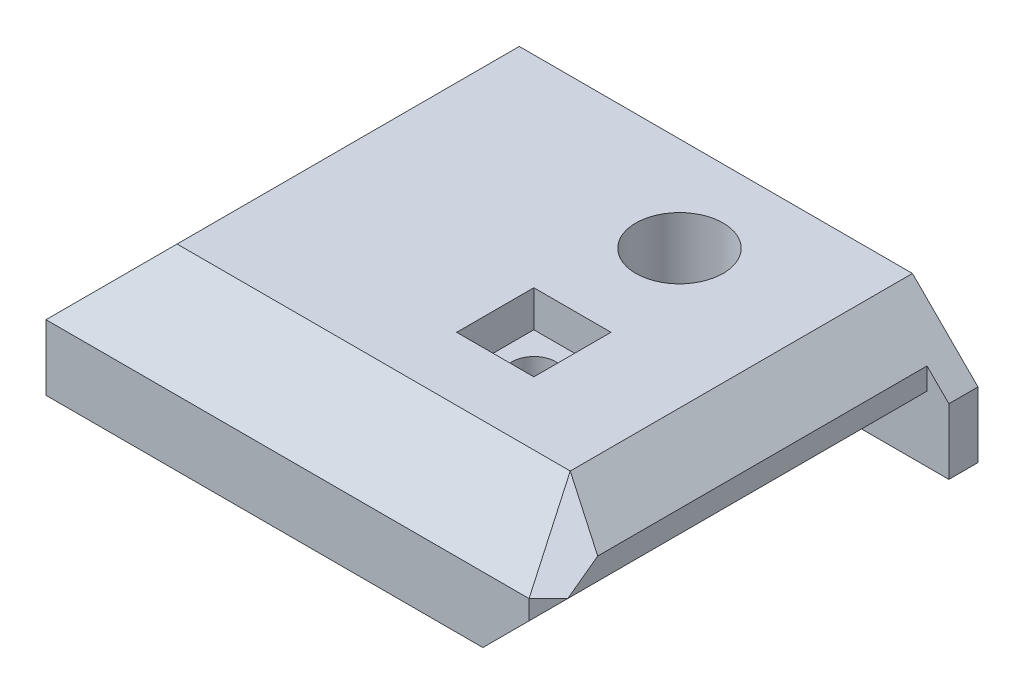
ISO-10303-21;
HEADER;
FILE_DESCRIPTION(('STEP AP214'),'2;1');
FILE_NAME('part.step','',(''),(''),'','','');
FILE_SCHEMA(('AUTOMOTIVE_DESIGN { 1 0 10303 214 1 1 1 1 }'));
ENDSEC;
DATA;
#1=APPLICATION_CONTEXT('core data for automotive mechanical design processes');
#2=APPLICATION_PROTOCOL_DEFINITION('international standard','automotive_design',2000,#1);
#3=PRODUCT_CONTEXT('',#1,'mechanical');
#4=PRODUCT('Part','Part','',(#3));
#5=PRODUCT_RELATED_PRODUCT_CATEGORY('part','',(#4));
#6=PRODUCT_DEFINITION_FORMATION('','',#4);
#7=PRODUCT_DEFINITION_CONTEXT('part definition',#1,'design');
#8=PRODUCT_DEFINITION('design','',#6,#7);
#9=PRODUCT_DEFINITION_SHAPE('','',#8);
#10=(LENGTH_UNIT() NAMED_UNIT(*) SI_UNIT(.MILLI.,.METRE.));
#11=(NAMED_UNIT(*) PLANE_ANGLE_UNIT() SI_UNIT($,.RADIAN.));
#12=(NAMED_UNIT(*) SI_UNIT($,.STERADIAN.) SOLID_ANGLE_UNIT());
#13=UNCERTAINTY_MEASURE_WITH_UNIT(LENGTH_MEASURE(1.E-05),#10,'distance_accuracy_value','');
#14=(GEOMETRIC_REPRESENTATION_CONTEXT(3) GLOBAL_UNCERTAINTY_ASSIGNED_CONTEXT((#13)) GLOBAL_UNIT_ASSIGNED_CONTEXT((#10,
#11,#12)) REPRESENTATION_CONTEXT('',''));
#15=CARTESIAN_POINT('',(0.,0.,0.));
#16=DIRECTION('',(0.,0.,1.));
#17=DIRECTION('',(1.,0.,0.));
#18=AXIS2_PLACEMENT_3D('',#15,#16,#17);
#19=CARTESIAN_POINT('',(36.,0.,28.));
#20=DIRECTION('',(0.,1.,0.));
#21=DIRECTION('',(0.,0.,1.));
#22=AXIS2_PLACEMENT_3D('',#19,#20,#21);
#23=PLANE('',#22);
#24=CARTESIAN_POINT('',(22.,0.,16.5));
#25=DIRECTION('',(0.,1.,0.));
#26=DIRECTION('',(0.,0.,1.));
#27=AXIS2_PLACEMENT_3D('',#24,#25,#26);
#28=CIRCLE('',#27,1.5);
#29=CARTESIAN_POINT('',(22.,0.,18.));
#30=VERTEX_POINT('',#29);
#31=EDGE_CURVE('E217',#30,#30,#28,.T.);
#32=ORIENTED_EDGE('',*,*,#31,.T.);
#33=EDGE_LOOP('',(#32));
#34=FACE_BOUND('',#33,.T.);
#35=CARTESIAN_POINT('',(22.,0.,6.5));
#36=DIRECTION('',(0.,1.,0.));
#37=DIRECTION('',(0.,0.,1.));
#38=AXIS2_PLACEMENT_3D('',#35,#36,#37);
#39=CIRCLE('',#38,1.5);
#40=CARTESIAN_POINT('',(22.,0.,8.));
#41=VERTEX_POINT('',#40);
#42=EDGE_CURVE('E223',#41,#41,#39,.F.);
#43=ORIENTED_EDGE('',*,*,#42,.F.);
#44=EDGE_LOOP('',(#43));
#45=FACE_BOUND('',#44,.T.);
#46=DIRECTION('',(1.,0.,0.));
#47=VECTOR('',#46,1.);
#48=CARTESIAN_POINT('',(36.,0.,2.));
#49=LINE('',#48,#47);
#50=CARTESIAN_POINT('',(30.,0.,2.));
#51=VERTEX_POINT('',#50);
#52=CARTESIAN_POINT('',(36.,0.,2.));
#53=VERTEX_POINT('',#52);
#54=EDGE_CURVE('E240',#51,#53,#49,.T.);
#55=ORIENTED_EDGE('',*,*,#54,.F.);
#56=DIRECTION('',(0.,0.,1.));
#57=VECTOR('',#56,1.);
#58=CARTESIAN_POINT('',(30.,0.,2.));
#59=LINE('',#58,#57);
#60=CARTESIAN_POINT('',(30.,0.,28.));
#61=VERTEX_POINT('',#60);
#62=EDGE_CURVE('E242',#51,#61,#59,.T.);
#63=ORIENTED_EDGE('',*,*,#62,.T.);
#64=DIRECTION('',(1.,0.,0.));
#65=VECTOR('',#64,1.);
#66=CARTESIAN_POINT('',(36.,0.,28.));
#67=LINE('',#66,#65);
#68=CARTESIAN_POINT('',(0.,0.,28.));
#69=VERTEX_POINT('',#68);
#70=EDGE_CURVE('E326',#69,#61,#67,.T.);
#71=ORIENTED_EDGE('',*,*,#70,.F.);
#72=DIRECTION('',(0.,0.,-1.));
#73=VECTOR('',#72,1.);
#74=CARTESIAN_POINT('',(0.,0.,28.));
#75=LINE('',#74,#73);
#76=CARTESIAN_POINT('',(0.,0.,0.));
#77=VERTEX_POINT('',#76);
#78=EDGE_CURVE('E332',#69,#77,#75,.T.);
#79=ORIENTED_EDGE('',*,*,#78,.T.);
#80=DIRECTION('',(1.,0.,0.));
#81=VECTOR('',#80,1.);
#82=CARTESIAN_POINT('',(36.,0.,0.));
#83=LINE('',#82,#81);
#84=CARTESIAN_POINT('',(5.,0.,0.));
#85=VERTEX_POINT('',#84);
#86=EDGE_CURVE('E333',#77,#85,#83,.T.);
#87=ORIENTED_EDGE('',*,*,#86,.T.);
#88=DIRECTION('',(0.,0.,-1.));
#89=VECTOR('',#88,1.);
#90=CARTESIAN_POINT('',(5.,0.,26.));
#91=LINE('',#90,#89);
#92=CARTESIAN_POINT('',(5.,0.,26.));
#93=VERTEX_POINT('',#92);
#94=EDGE_CURVE('E268',#93,#85,#91,.T.);
#95=ORIENTED_EDGE('',*,*,#94,.F.);
#96=DIRECTION('',(1.,0.,0.));
#97=VECTOR('',#96,1.);
#98=CARTESIAN_POINT('',(5.,0.,26.));
#99=LINE('',#98,#97);
#100=CARTESIAN_POINT('',(13.8116308862596,0.,26.));
#101=VERTEX_POINT('',#100);
#102=EDGE_CURVE('E254',#93,#101,#99,.T.);
#103=ORIENTED_EDGE('',*,*,#102,.T.);
#104=DIRECTION('',(0.,0.,-1.));
#105=VECTOR('',#104,1.);
#106=CARTESIAN_POINT('',(13.8116308862596,0.,26.));
#107=LINE('',#106,#105);
#108=CARTESIAN_POINT('',(13.8116308862596,0.,0.));
#109=VERTEX_POINT('',#108);
#110=EDGE_CURVE('E291',#101,#109,#107,.T.);
#111=ORIENTED_EDGE('',*,*,#110,.T.);
#112=CARTESIAN_POINT('',(36.,0.,0.));
#113=VERTEX_POINT('',#112);
#114=EDGE_CURVE('E320',#109,#113,#83,.T.);
#115=ORIENTED_EDGE('',*,*,#114,.T.);
#116=DIRECTION('',(0.,0.,-1.));
#117=VECTOR('',#116,1.);
#118=CARTESIAN_POINT('',(36.,0.,28.));
#119=LINE('',#118,#117);
#120=EDGE_CURVE('E345',#53,#113,#119,.T.);
#121=ORIENTED_EDGE('',*,*,#120,.F.);
#122=EDGE_LOOP('',(#55,#63,#71,#79,#87,#95,#103,#111,#115,#121));
#123=FACE_BOUND('',#122,.T.);
#124=ADVANCED_FACE('F41',(#34,#45,#123),#23,.F.);
#125=CARTESIAN_POINT('',(0.,0.,0.));
#126=DIRECTION('',(0.,0.,-1.));
#127=DIRECTION('',(-1.,0.,0.));
#128=AXIS2_PLACEMENT_3D('',#125,#126,#127);
#129=PLANE('',#128);
#130=ORIENTED_EDGE('',*,*,#114,.F.);
#131=DIRECTION('',(0.,1.,0.));
#132=VECTOR('',#131,1.);
#133=CARTESIAN_POINT('',(13.8116308862596,0.,0.));
#134=LINE('',#133,#132);
#135=CARTESIAN_POINT('',(13.8116308862596,3.,0.));
#136=VERTEX_POINT('',#135);
#137=EDGE_CURVE('E253',#109,#136,#134,.T.);
#138=ORIENTED_EDGE('',*,*,#137,.T.);
#139=DIRECTION('',(-0.707106781186551,0.707106781186544,0.));
#140=VECTOR('',#139,1.);
#141=CARTESIAN_POINT('',(13.8116308862596,3.,0.));
#142=LINE('',#141,#140);
#143=CARTESIAN_POINT('',(13.104524105073,3.70710678118655,0.));
#144=VERTEX_POINT('',#143);
#145=EDGE_CURVE('E271',#136,#144,#142,.T.);
#146=ORIENTED_EDGE('',*,*,#145,.T.);
#147=DIRECTION('',(-1.,0.,0.));
#148=VECTOR('',#147,1.);
#149=CARTESIAN_POINT('',(5.70710678118655,3.70710678118655,0.));
#150=LINE('',#149,#148);
#151=CARTESIAN_POINT('',(5.70710678118655,3.70710678118655,0.));
#152=VERTEX_POINT('',#151);
#153=EDGE_CURVE('E274',#144,#152,#150,.T.);
#154=ORIENTED_EDGE('',*,*,#153,.T.);
#155=DIRECTION('',(-0.707106781186547,-0.707106781186547,0.));
#156=VECTOR('',#155,1.);
#157=CARTESIAN_POINT('',(5.,3.,0.));
#158=LINE('',#157,#156);
#159=CARTESIAN_POINT('',(5.,3.,0.));
#160=VERTEX_POINT('',#159);
#161=EDGE_CURVE('E277',#152,#160,#158,.T.);
#162=ORIENTED_EDGE('',*,*,#161,.T.);
#163=DIRECTION('',(0.,-1.,0.));
#164=VECTOR('',#163,1.);
#165=CARTESIAN_POINT('',(5.,0.,0.));
#166=LINE('',#165,#164);
#167=EDGE_CURVE('E258',#160,#85,#166,.T.);
#168=ORIENTED_EDGE('',*,*,#167,.T.);
#169=ORIENTED_EDGE('',*,*,#86,.F.);
#170=DIRECTION('',(0.,-1.,0.));
#171=VECTOR('',#170,1.);
#172=CARTESIAN_POINT('',(0.,0.,0.));
#173=LINE('',#172,#171);
#174=CARTESIAN_POINT('',(0.,4.5,0.));
#175=VERTEX_POINT('',#174);
#176=EDGE_CURVE('E330',#175,#77,#173,.T.);
#177=ORIENTED_EDGE('',*,*,#176,.F.);
#178=DIRECTION('',(0.707106781186546,0.707106781186549,0.));
#179=VECTOR('',#178,1.);
#180=CARTESIAN_POINT('',(0.,4.5,0.));
#181=LINE('',#180,#179);
#182=CARTESIAN_POINT('',(4.49999999999998,9.,0.));
#183=VERTEX_POINT('',#182);
#184=EDGE_CURVE('E311',#175,#183,#181,.T.);
#185=ORIENTED_EDGE('',*,*,#184,.T.);
#186=DIRECTION('',(-1.,0.,0.));
#187=VECTOR('',#186,1.);
#188=CARTESIAN_POINT('',(0.,9.,0.));
#189=LINE('',#188,#187);
#190=CARTESIAN_POINT('',(31.5,9.,0.));
#191=VERTEX_POINT('',#190);
#192=EDGE_CURVE('E339',#191,#183,#189,.T.);
#193=ORIENTED_EDGE('',*,*,#192,.F.);
#194=DIRECTION('',(0.707106781186546,-0.707106781186549,0.));
#195=VECTOR('',#194,1.);
#196=CARTESIAN_POINT('',(36.,4.5,0.));
#197=LINE('',#196,#195);
#198=CARTESIAN_POINT('',(36.,4.50000000000001,0.));
#199=VERTEX_POINT('',#198);
#200=EDGE_CURVE('E315',#191,#199,#197,.T.);
#201=ORIENTED_EDGE('',*,*,#200,.T.);
#202=DIRECTION('',(0.,1.,0.));
#203=VECTOR('',#202,1.);
#204=CARTESIAN_POINT('',(36.,9.,0.));
#205=LINE('',#204,#203);
#206=EDGE_CURVE('E336',#113,#199,#205,.T.);
#207=ORIENTED_EDGE('',*,*,#206,.F.);
#208=EDGE_LOOP('',(#130,#138,#146,#154,#162,#168,#169,#177,#185,#193,#201,#207));
#209=FACE_BOUND('',#208,.T.);
#210=ADVANCED_FACE('F379',(#209),#129,.T.);
#211=CARTESIAN_POINT('',(36.,4.5,28.));
#212=DIRECTION('',(0.707106781186549,0.707106781186547,0.));
#213=DIRECTION('',(-0.707106781186546,0.707106781186549,0.));
#214=AXIS2_PLACEMENT_3D('',#211,#212,#213);
#215=PLANE('',#214);
#216=DIRECTION('',(0.,0.,1.));
#217=VECTOR('',#216,1.);
#218=CARTESIAN_POINT('',(34.5,5.99999999999998,2.));
#219=LINE('',#218,#217);
#220=CARTESIAN_POINT('',(34.5,5.99999999999998,2.));
#221=VERTEX_POINT('',#220);
#222=CARTESIAN_POINT('',(34.5,5.99999999999998,24.6143819168359));
#223=VERTEX_POINT('',#222);
#224=EDGE_CURVE('E64',#221,#223,#219,.T.);
#225=ORIENTED_EDGE('',*,*,#224,.F.);
#226=DIRECTION('',(-0.707106781186546,0.707106781186549,0.));
#227=VECTOR('',#226,1.);
#228=CARTESIAN_POINT('',(36.,4.5,2.));
#229=LINE('',#228,#227);
#230=CARTESIAN_POINT('',(36.,4.50000000000001,2.));
#231=VERTEX_POINT('',#230);
#232=EDGE_CURVE('E245',#231,#221,#229,.T.);
#233=ORIENTED_EDGE('',*,*,#232,.F.);
#234=DIRECTION('',(0.,0.,-1.));
#235=VECTOR('',#234,1.);
#236=CARTESIAN_POINT('',(36.,4.5,28.));
#237=LINE('',#236,#235);
#238=EDGE_CURVE('E322',#231,#199,#237,.T.);
#239=ORIENTED_EDGE('',*,*,#238,.T.);
#240=ORIENTED_EDGE('',*,*,#200,.F.);
#241=DIRECTION('',(0.,0.,-1.));
#242=VECTOR('',#241,1.);
#243=CARTESIAN_POINT('',(31.5,9.,28.));
#244=LINE('',#243,#242);
#245=CARTESIAN_POINT('',(31.5,9.,23.5));
#246=VERTEX_POINT('',#245);
#247=EDGE_CURVE('E310',#246,#191,#244,.T.);
#248=ORIENTED_EDGE('',*,*,#247,.F.);
#249=DIRECTION('',(0.683908301776168,-0.68390830177617,0.254045014757763));
#250=VECTOR('',#249,1.);
#251=CARTESIAN_POINT('',(36.4914208129248,4.00857918707516,25.3541163644139));
#252=LINE('',#251,#250);
#253=EDGE_CURVE('E300',#246,#223,#252,.T.);
#254=ORIENTED_EDGE('',*,*,#253,.T.);
#255=EDGE_LOOP('',(#225,#233,#239,#240,#248,#254));
#256=FACE_BOUND('',#255,.T.);
#257=ADVANCED_FACE('F372',(#256),#215,.T.);
#258=CARTESIAN_POINT('',(36.,4.5,28.));
#259=DIRECTION('',(0.,0.707106781186546,0.707106781186549));
#260=DIRECTION('',(0.,-0.707106781186549,0.707106781186546));
#261=AXIS2_PLACEMENT_3D('',#258,#259,#260);
#262=PLANE('',#261);
#263=DIRECTION('',(-1.,0.,0.));
#264=VECTOR('',#263,1.);
#265=CARTESIAN_POINT('',(36.,4.5,28.));
#266=LINE('',#265,#264);
#267=CARTESIAN_POINT('',(33.1715728752538,4.5,28.));
#268=VERTEX_POINT('',#267);
#269=CARTESIAN_POINT('',(0.,4.5,28.));
#270=VERTEX_POINT('',#269);
#271=EDGE_CURVE('E308',#268,#270,#266,.T.);
#272=ORIENTED_EDGE('',*,*,#271,.F.);
#273=DIRECTION('',(-0.254045014757767,0.68390830177617,-0.683908301776167));
#274=VECTOR('',#273,1.);
#275=CARTESIAN_POINT('',(33.3541163644139,4.00857918707515,28.4914208129248));
#276=LINE('',#275,#274);
#277=EDGE_CURVE('E297',#268,#246,#276,.T.);
#278=ORIENTED_EDGE('',*,*,#277,.T.);
#279=DIRECTION('',(-1.,0.,0.));
#280=VECTOR('',#279,1.);
#281=CARTESIAN_POINT('',(36.,9.,23.5));
#282=LINE('',#281,#280);
#283=CARTESIAN_POINT('',(4.49999999999998,9.,23.5));
#284=VERTEX_POINT('',#283);
#285=EDGE_CURVE('E306',#246,#284,#282,.T.);
#286=ORIENTED_EDGE('',*,*,#285,.T.);
#287=DIRECTION('',(0.577350269189625,0.577350269189627,-0.577350269189625));
#288=VECTOR('',#287,1.);
#289=CARTESIAN_POINT('',(0.,4.5,28.));
#290=LINE('',#289,#288);
#291=EDGE_CURVE('E347',#270,#284,#290,.T.);
#292=ORIENTED_EDGE('',*,*,#291,.F.);
#293=EDGE_LOOP('',(#272,#278,#286,#292));
#294=FACE_BOUND('',#293,.T.);
#295=ADVANCED_FACE('F364',(#294),#262,.T.);
#296=CARTESIAN_POINT('',(30.585786437627,0.,30.5857864376269));
#297=DIRECTION('',(0.707106781186549,0.,0.707106781186546));
#298=DIRECTION('',(0.707106781186546,0.,-0.707106781186549));
#299=AXIS2_PLACEMENT_3D('',#296,#297,#298);
#300=PLANE('',#299);
#301=DIRECTION('',(-0.577350269189626,-0.577350269189623,0.577350269189628));
#302=VECTOR('',#301,1.);
#303=CARTESIAN_POINT('',(30.3905242917513,0.390524291751312,30.7810485835025));
#304=LINE('',#303,#302);
#305=CARTESIAN_POINT('',(34.5,4.5,26.6715728752538));
#306=VERTEX_POINT('',#305);
#307=CARTESIAN_POINT('',(33.1715728752538,3.17157287525381,28.));
#308=VERTEX_POINT('',#307);
#309=EDGE_CURVE('E251',#306,#308,#304,.T.);
#310=ORIENTED_EDGE('',*,*,#309,.F.);
#311=DIRECTION('',(0.707106781186546,0.,-0.707106781186549));
#312=VECTOR('',#311,1.);
#313=CARTESIAN_POINT('',(33.1715728752538,4.5,28.));
#314=LINE('',#313,#312);
#315=EDGE_CURVE('E294',#268,#306,#314,.T.);
#316=ORIENTED_EDGE('',*,*,#315,.F.);
#317=DIRECTION('',(0.,-1.,0.));
#318=VECTOR('',#317,1.);
#319=CARTESIAN_POINT('',(33.1715728752538,0.,28.));
#320=LINE('',#319,#318);
#321=EDGE_CURVE('E303',#268,#308,#320,.T.);
#322=ORIENTED_EDGE('',*,*,#321,.T.);
#323=EDGE_LOOP('',(#310,#316,#322));
#324=FACE_BOUND('',#323,.T.);
#325=ADVANCED_FACE('F358',(#324),#300,.T.);
#326=CARTESIAN_POINT('',(0.,0.,28.));
#327=DIRECTION('',(0.,0.,-1.));
#328=DIRECTION('',(-1.,0.,0.));
#329=AXIS2_PLACEMENT_3D('',#326,#327,#328);
#330=PLANE('',#329);
#331=ORIENTED_EDGE('',*,*,#70,.T.);
#332=DIRECTION('',(0.70710678118655,0.707106781186545,0.));
#333=VECTOR('',#332,1.);
#334=CARTESIAN_POINT('',(14.9999999999999,-15.,28.));
#335=LINE('',#334,#333);
#336=EDGE_CURVE('E11',#61,#308,#335,.T.);
#337=ORIENTED_EDGE('',*,*,#336,.T.);
#338=ORIENTED_EDGE('',*,*,#321,.F.);
#339=ORIENTED_EDGE('',*,*,#271,.T.);
#340=DIRECTION('',(0.,-1.,0.));
#341=VECTOR('',#340,1.);
#342=CARTESIAN_POINT('',(0.,0.,28.));
#343=LINE('',#342,#341);
#344=EDGE_CURVE('E329',#270,#69,#343,.T.);
#345=ORIENTED_EDGE('',*,*,#344,.T.);
#346=EDGE_LOOP('',(#331,#337,#338,#339,#345));
#347=FACE_BOUND('',#346,.T.);
#348=ADVANCED_FACE('F391',(#347),#330,.F.);
#349=CARTESIAN_POINT('',(36.,9.,28.));
#350=DIRECTION('',(-1.,0.,0.));
#351=DIRECTION('',(0.,0.,1.));
#352=AXIS2_PLACEMENT_3D('',#349,#350,#351);
#353=PLANE('',#352);
#354=ORIENTED_EDGE('',*,*,#238,.F.);
#355=DIRECTION('',(0.,1.,0.));
#356=VECTOR('',#355,1.);
#357=CARTESIAN_POINT('',(36.,5.99999999999998,2.));
#358=LINE('',#357,#356);
#359=EDGE_CURVE('E230',#53,#231,#358,.T.);
#360=ORIENTED_EDGE('',*,*,#359,.F.);
#361=ORIENTED_EDGE('',*,*,#120,.T.);
#362=ORIENTED_EDGE('',*,*,#206,.T.);
#363=EDGE_LOOP('',(#354,#360,#361,#362));
#364=FACE_BOUND('',#363,.T.);
#365=ADVANCED_FACE('F400',(#364),#353,.F.);
#366=CARTESIAN_POINT('',(0.,9.,28.));
#367=DIRECTION('',(0.,-1.,0.));
#368=DIRECTION('',(0.,0.,-1.));
#369=AXIS2_PLACEMENT_3D('',#366,#367,#368);
#370=PLANE('',#369);
#371=DIRECTION('',(1.,0.,0.));
#372=VECTOR('',#371,1.);
#373=CARTESIAN_POINT('',(19.35,9.,19.15));
#374=LINE('',#373,#372);
#375=CARTESIAN_POINT('',(19.35,9.,19.15));
#376=VERTEX_POINT('',#375);
#377=CARTESIAN_POINT('',(24.65,9.,19.15));
#378=VERTEX_POINT('',#377);
#379=EDGE_CURVE('E208',#376,#378,#374,.T.);
#380=ORIENTED_EDGE('',*,*,#379,.F.);
#381=DIRECTION('',(0.,0.,1.));
#382=VECTOR('',#381,1.);
#383=CARTESIAN_POINT('',(19.35,9.,19.15));
#384=LINE('',#383,#382);
#385=CARTESIAN_POINT('',(19.35,9.,13.85));
#386=VERTEX_POINT('',#385);
#387=EDGE_CURVE('E56',#386,#376,#384,.T.);
#388=ORIENTED_EDGE('',*,*,#387,.F.);
#389=DIRECTION('',(-1.,0.,0.));
#390=VECTOR('',#389,1.);
#391=CARTESIAN_POINT('',(19.35,9.,13.85));
#392=LINE('',#391,#390);
#393=CARTESIAN_POINT('',(24.65,9.,13.85));
#394=VERTEX_POINT('',#393);
#395=EDGE_CURVE('E199',#394,#386,#392,.T.);
#396=ORIENTED_EDGE('',*,*,#395,.F.);
#397=DIRECTION('',(0.,0.,-1.));
#398=VECTOR('',#397,1.);
#399=CARTESIAN_POINT('',(24.65,9.,19.15));
#400=LINE('',#399,#398);
#401=EDGE_CURVE('E202',#378,#394,#400,.T.);
#402=ORIENTED_EDGE('',*,*,#401,.F.);
#403=EDGE_LOOP('',(#380,#388,#396,#402));
#404=FACE_BOUND('',#403,.T.);
#405=CARTESIAN_POINT('',(22.,9.,6.5));
#406=DIRECTION('',(0.,1.,0.));
#407=DIRECTION('',(0.,0.,1.));
#408=AXIS2_PLACEMENT_3D('',#405,#406,#407);
#409=CIRCLE('',#408,3.);
#410=CARTESIAN_POINT('',(22.,9.,9.5));
#411=VERTEX_POINT('',#410);
#412=EDGE_CURVE('E226',#411,#411,#409,.T.);
#413=ORIENTED_EDGE('',*,*,#412,.F.);
#414=EDGE_LOOP('',(#413));
#415=FACE_BOUND('',#414,.T.);
#416=ORIENTED_EDGE('',*,*,#285,.F.);
#417=ORIENTED_EDGE('',*,*,#247,.T.);
#418=ORIENTED_EDGE('',*,*,#192,.T.);
#419=DIRECTION('',(0.,0.,-1.));
#420=VECTOR('',#419,1.);
#421=CARTESIAN_POINT('',(4.49999999999998,9.,28.));
#422=LINE('',#421,#420);
#423=EDGE_CURVE('E314',#284,#183,#422,.T.);
#424=ORIENTED_EDGE('',*,*,#423,.F.);
#425=EDGE_LOOP('',(#416,#417,#418,#424));
#426=FACE_BOUND('',#425,.T.);
#427=ADVANCED_FACE('F369',(#404,#415,#426),#370,.F.);
#428=CARTESIAN_POINT('',(0.,4.5,28.));
#429=DIRECTION('',(-0.707106781186549,0.707106781186546,0.));
#430=DIRECTION('',(-0.707106781186546,-0.707106781186549,0.));
#431=AXIS2_PLACEMENT_3D('',#428,#429,#430);
#432=PLANE('',#431);
#433=DIRECTION('',(0.,0.,-1.));
#434=VECTOR('',#433,1.);
#435=CARTESIAN_POINT('',(0.,4.5,28.));
#436=LINE('',#435,#434);
#437=EDGE_CURVE('E317',#270,#175,#436,.T.);
#438=ORIENTED_EDGE('',*,*,#437,.F.);
#439=ORIENTED_EDGE('',*,*,#291,.T.);
#440=ORIENTED_EDGE('',*,*,#423,.T.);
#441=ORIENTED_EDGE('',*,*,#184,.F.);
#442=EDGE_LOOP('',(#438,#439,#440,#441));
#443=FACE_BOUND('',#442,.T.);
#444=ADVANCED_FACE('F384',(#443),#432,.T.);
#445=CARTESIAN_POINT('',(0.,0.,28.));
#446=DIRECTION('',(1.,0.,0.));
#447=DIRECTION('',(0.,0.,-1.));
#448=AXIS2_PLACEMENT_3D('',#445,#446,#447);
#449=PLANE('',#448);
#450=ORIENTED_EDGE('',*,*,#437,.T.);
#451=ORIENTED_EDGE('',*,*,#176,.T.);
#452=ORIENTED_EDGE('',*,*,#78,.F.);
#453=ORIENTED_EDGE('',*,*,#344,.F.);
#454=EDGE_LOOP('',(#450,#451,#452,#453));
#455=FACE_BOUND('',#454,.T.);
#456=ADVANCED_FACE('F387',(#455),#449,.F.);
#457=CARTESIAN_POINT('',(30.0857864376269,9.00000000000001,24.9142135623731));
#458=DIRECTION('',(0.507613933017222,0.696172528913327,0.507613933017219));
#459=DIRECTION('',(-0.808014088376717,0.589163163295826,0.));
#460=AXIS2_PLACEMENT_3D('',#457,#458,#459);
#461=PLANE('',#460);
#462=DIRECTION('',(0.,-0.589163163295823,0.808014088376719));
#463=VECTOR('',#462,1.);
#464=CARTESIAN_POINT('',(34.5,6.89860420356718,23.3819816216527));
#465=LINE('',#464,#463);
#466=EDGE_CURVE('E49',#223,#306,#465,.T.);
#467=ORIENTED_EDGE('',*,*,#466,.F.);
#468=ORIENTED_EDGE('',*,*,#253,.F.);
#469=ORIENTED_EDGE('',*,*,#277,.F.);
#470=ORIENTED_EDGE('',*,*,#315,.T.);
#471=EDGE_LOOP('',(#467,#468,#469,#470));
#472=FACE_BOUND('',#471,.T.);
#473=ADVANCED_FACE('F360',(#472),#461,.T.);
#474=CARTESIAN_POINT('',(13.8116308862596,0.,26.));
#475=DIRECTION('',(-1.,0.,0.));
#476=DIRECTION('',(0.,0.,1.));
#477=AXIS2_PLACEMENT_3D('',#474,#475,#476);
#478=PLANE('',#477);
#479=ORIENTED_EDGE('',*,*,#137,.F.);
#480=ORIENTED_EDGE('',*,*,#110,.F.);
#481=DIRECTION('',(0.,1.,0.));
#482=VECTOR('',#481,1.);
#483=CARTESIAN_POINT('',(13.8116308862596,0.,26.));
#484=LINE('',#483,#482);
#485=CARTESIAN_POINT('',(13.8116308862596,3.,26.));
#486=VERTEX_POINT('',#485);
#487=EDGE_CURVE('E257',#101,#486,#484,.T.);
#488=ORIENTED_EDGE('',*,*,#487,.T.);
#489=DIRECTION('',(0.,0.,-1.));
#490=VECTOR('',#489,1.);
#491=CARTESIAN_POINT('',(13.8116308862596,3.,26.));
#492=LINE('',#491,#490);
#493=EDGE_CURVE('E289',#486,#136,#492,.T.);
#494=ORIENTED_EDGE('',*,*,#493,.T.);
#495=EDGE_LOOP('',(#479,#480,#488,#494));
#496=FACE_BOUND('',#495,.T.);
#497=ADVANCED_FACE('F405',(#496),#478,.T.);
#498=CARTESIAN_POINT('',(13.8116308862596,3.,26.));
#499=DIRECTION('',(-0.707106781186544,-0.707106781186551,0.));
#500=DIRECTION('',(0.707106781186551,-0.707106781186544,0.));
#501=AXIS2_PLACEMENT_3D('',#498,#499,#500);
#502=PLANE('',#501);
#503=ORIENTED_EDGE('',*,*,#145,.F.);
#504=ORIENTED_EDGE('',*,*,#493,.F.);
#505=DIRECTION('',(-0.707106781186551,0.707106781186544,0.));
#506=VECTOR('',#505,1.);
#507=CARTESIAN_POINT('',(13.8116308862596,3.,26.));
#508=LINE('',#507,#506);
#509=CARTESIAN_POINT('',(13.104524105073,3.70710678118655,26.));
#510=VERTEX_POINT('',#509);
#511=EDGE_CURVE('E260',#486,#510,#508,.T.);
#512=ORIENTED_EDGE('',*,*,#511,.T.);
#513=DIRECTION('',(0.,0.,-1.));
#514=VECTOR('',#513,1.);
#515=CARTESIAN_POINT('',(13.104524105073,3.70710678118655,26.));
#516=LINE('',#515,#514);
#517=EDGE_CURVE('E287',#510,#144,#516,.T.);
#518=ORIENTED_EDGE('',*,*,#517,.T.);
#519=EDGE_LOOP('',(#503,#504,#512,#518));
#520=FACE_BOUND('',#519,.T.);
#521=ADVANCED_FACE('F410',(#520),#502,.T.);
#522=CARTESIAN_POINT('',(5.70710678118655,3.70710678118655,26.));
#523=DIRECTION('',(0.,-1.,0.));
#524=DIRECTION('',(0.,0.,-1.));
#525=AXIS2_PLACEMENT_3D('',#522,#523,#524);
#526=PLANE('',#525);
#527=ORIENTED_EDGE('',*,*,#153,.F.);
#528=ORIENTED_EDGE('',*,*,#517,.F.);
#529=DIRECTION('',(-1.,0.,0.));
#530=VECTOR('',#529,1.);
#531=CARTESIAN_POINT('',(5.70710678118655,3.70710678118655,26.));
#532=LINE('',#531,#530);
#533=CARTESIAN_POINT('',(5.70710678118655,3.70710678118655,26.));
#534=VERTEX_POINT('',#533);
#535=EDGE_CURVE('E262',#510,#534,#532,.T.);
#536=ORIENTED_EDGE('',*,*,#535,.T.);
#537=DIRECTION('',(0.,0.,-1.));
#538=VECTOR('',#537,1.);
#539=CARTESIAN_POINT('',(5.70710678118655,3.70710678118655,26.));
#540=LINE('',#539,#538);
#541=EDGE_CURVE('E285',#534,#152,#540,.T.);
#542=ORIENTED_EDGE('',*,*,#541,.T.);
#543=EDGE_LOOP('',(#527,#528,#536,#542));
#544=FACE_BOUND('',#543,.T.);
#545=ADVANCED_FACE('F415',(#544),#526,.T.);
#546=CARTESIAN_POINT('',(5.,3.,26.));
#547=DIRECTION('',(0.707106781186548,-0.707106781186548,0.));
#548=DIRECTION('',(0.707106781186548,0.707106781186548,0.));
#549=AXIS2_PLACEMENT_3D('',#546,#547,#548);
#550=PLANE('',#549);
#551=ORIENTED_EDGE('',*,*,#161,.F.);
#552=ORIENTED_EDGE('',*,*,#541,.F.);
#553=DIRECTION('',(-0.707106781186547,-0.707106781186547,0.));
#554=VECTOR('',#553,1.);
#555=CARTESIAN_POINT('',(5.,3.,26.));
#556=LINE('',#555,#554);
#557=CARTESIAN_POINT('',(5.,3.,26.));
#558=VERTEX_POINT('',#557);
#559=EDGE_CURVE('E264',#534,#558,#556,.T.);
#560=ORIENTED_EDGE('',*,*,#559,.T.);
#561=DIRECTION('',(0.,0.,-1.));
#562=VECTOR('',#561,1.);
#563=CARTESIAN_POINT('',(5.,3.,26.));
#564=LINE('',#563,#562);
#565=EDGE_CURVE('E283',#558,#160,#564,.T.);
#566=ORIENTED_EDGE('',*,*,#565,.T.);
#567=EDGE_LOOP('',(#551,#552,#560,#566));
#568=FACE_BOUND('',#567,.T.);
#569=ADVANCED_FACE('F420',(#568),#550,.T.);
#570=CARTESIAN_POINT('',(5.,0.,26.));
#571=DIRECTION('',(1.,0.,0.));
#572=DIRECTION('',(0.,0.,-1.));
#573=AXIS2_PLACEMENT_3D('',#570,#571,#572);
#574=PLANE('',#573);
#575=ORIENTED_EDGE('',*,*,#167,.F.);
#576=ORIENTED_EDGE('',*,*,#565,.F.);
#577=DIRECTION('',(0.,-1.,0.));
#578=VECTOR('',#577,1.);
#579=CARTESIAN_POINT('',(5.,0.,26.));
#580=LINE('',#579,#578);
#581=EDGE_CURVE('E266',#558,#93,#580,.T.);
#582=ORIENTED_EDGE('',*,*,#581,.T.);
#583=ORIENTED_EDGE('',*,*,#94,.T.);
#584=EDGE_LOOP('',(#575,#576,#582,#583));
#585=FACE_BOUND('',#584,.T.);
#586=ADVANCED_FACE('F425',(#585),#574,.T.);
#587=CARTESIAN_POINT('',(0.,0.,26.));
#588=DIRECTION('',(0.,0.,1.));
#589=DIRECTION('',(1.,0.,0.));
#590=AXIS2_PLACEMENT_3D('',#587,#588,#589);
#591=PLANE('',#590);
#592=ORIENTED_EDGE('',*,*,#102,.F.);
#593=ORIENTED_EDGE('',*,*,#581,.F.);
#594=ORIENTED_EDGE('',*,*,#559,.F.);
#595=ORIENTED_EDGE('',*,*,#535,.F.);
#596=ORIENTED_EDGE('',*,*,#511,.F.);
#597=ORIENTED_EDGE('',*,*,#487,.F.);
#598=EDGE_LOOP('',(#592,#593,#594,#595,#596,#597));
#599=FACE_BOUND('',#598,.T.);
#600=ADVANCED_FACE('F427',(#599),#591,.F.);
#601=CARTESIAN_POINT('',(34.5,4.5,2.));
#602=DIRECTION('',(-0.707106781186545,0.70710678118655,0.));
#603=DIRECTION('',(-0.70710678118655,-0.707106781186545,0.));
#604=AXIS2_PLACEMENT_3D('',#601,#602,#603);
#605=PLANE('',#604);
#606=ORIENTED_EDGE('',*,*,#309,.T.);
#607=ORIENTED_EDGE('',*,*,#336,.F.);
#608=ORIENTED_EDGE('',*,*,#62,.F.);
#609=DIRECTION('',(-0.70710678118655,-0.707106781186545,0.));
#610=VECTOR('',#609,1.);
#611=CARTESIAN_POINT('',(34.5,4.5,2.));
#612=LINE('',#611,#610);
#613=CARTESIAN_POINT('',(34.5,4.5,2.));
#614=VERTEX_POINT('',#613);
#615=EDGE_CURVE('E237',#614,#51,#612,.T.);
#616=ORIENTED_EDGE('',*,*,#615,.F.);
#617=DIRECTION('',(0.,0.,1.));
#618=VECTOR('',#617,1.);
#619=CARTESIAN_POINT('',(34.5,4.5,2.));
#620=LINE('',#619,#618);
#621=EDGE_CURVE('E246',#614,#306,#620,.T.);
#622=ORIENTED_EDGE('',*,*,#621,.T.);
#623=EDGE_LOOP('',(#606,#607,#608,#616,#622));
#624=FACE_BOUND('',#623,.T.);
#625=ADVANCED_FACE('F355',(#624),#605,.F.);
#626=CARTESIAN_POINT('',(34.5,4.5,2.));
#627=DIRECTION('',(-1.,0.,0.));
#628=DIRECTION('',(0.,0.,1.));
#629=AXIS2_PLACEMENT_3D('',#626,#627,#628);
#630=PLANE('',#629);
#631=ORIENTED_EDGE('',*,*,#466,.T.);
#632=ORIENTED_EDGE('',*,*,#621,.F.);
#633=DIRECTION('',(0.,-1.,0.));
#634=VECTOR('',#633,1.);
#635=CARTESIAN_POINT('',(34.5,4.5,2.));
#636=LINE('',#635,#634);
#637=EDGE_CURVE('E234',#221,#614,#636,.T.);
#638=ORIENTED_EDGE('',*,*,#637,.F.);
#639=ORIENTED_EDGE('',*,*,#224,.T.);
#640=EDGE_LOOP('',(#631,#632,#638,#639));
#641=FACE_BOUND('',#640,.T.);
#642=ADVANCED_FACE('F350',(#641),#630,.F.);
#643=CARTESIAN_POINT('',(0.,0.,2.));
#644=DIRECTION('',(0.,0.,-1.));
#645=DIRECTION('',(-1.,0.,0.));
#646=AXIS2_PLACEMENT_3D('',#643,#644,#645);
#647=PLANE('',#646);
#648=ORIENTED_EDGE('',*,*,#232,.T.);
#649=ORIENTED_EDGE('',*,*,#637,.T.);
#650=ORIENTED_EDGE('',*,*,#615,.T.);
#651=ORIENTED_EDGE('',*,*,#54,.T.);
#652=ORIENTED_EDGE('',*,*,#359,.T.);
#653=EDGE_LOOP('',(#648,#649,#650,#651,#652));
#654=FACE_BOUND('',#653,.T.);
#655=ADVANCED_FACE('F398',(#654),#647,.F.);
#656=CARTESIAN_POINT('',(22.,2.,6.5));
#657=DIRECTION('',(0.,1.,0.));
#658=DIRECTION('',(0.,0.,1.));
#659=AXIS2_PLACEMENT_3D('',#656,#657,#658);
#660=CYLINDRICAL_SURFACE('',#659,3.);
#661=CARTESIAN_POINT('',(22.,2.,6.5));
#662=DIRECTION('',(0.,1.,0.));
#663=DIRECTION('',(0.,0.,1.));
#664=AXIS2_PLACEMENT_3D('',#661,#662,#663);
#665=CIRCLE('',#664,3.);
#666=CARTESIAN_POINT('',(22.,2.,9.5));
#667=VERTEX_POINT('',#666);
#668=EDGE_CURVE('E227',#667,#667,#665,.T.);
#669=ORIENTED_EDGE('',*,*,#668,.F.);
#670=EDGE_LOOP('',(#669));
#671=FACE_BOUND('',#670,.T.);
#672=ORIENTED_EDGE('',*,*,#412,.T.);
#673=EDGE_LOOP('',(#672));
#674=FACE_BOUND('',#673,.T.);
#675=ADVANCED_FACE('F459',(#671,#674),#660,.F.);
#676=CARTESIAN_POINT('',(22.,2.,6.5));
#677=DIRECTION('',(0.,1.,0.));
#678=DIRECTION('',(0.,0.,1.));
#679=AXIS2_PLACEMENT_3D('',#676,#677,#678);
#680=PLANE('',#679);
#681=CARTESIAN_POINT('',(22.,2.,6.5));
#682=DIRECTION('',(0.,1.,0.));
#683=DIRECTION('',(0.,0.,1.));
#684=AXIS2_PLACEMENT_3D('',#681,#682,#683);
#685=CIRCLE('',#684,1.5);
#686=CARTESIAN_POINT('',(22.,2.,8.));
#687=VERTEX_POINT('',#686);
#688=EDGE_CURVE('E220',#687,#687,#685,.T.);
#689=ORIENTED_EDGE('',*,*,#688,.F.);
#690=EDGE_LOOP('',(#689));
#691=FACE_BOUND('',#690,.T.);
#692=ORIENTED_EDGE('',*,*,#668,.T.);
#693=EDGE_LOOP('',(#692));
#694=FACE_BOUND('',#693,.T.);
#695=ADVANCED_FACE('F453',(#691,#694),#680,.T.);
#696=CARTESIAN_POINT('',(22.,-4.24264068711929,6.5));
#697=DIRECTION('',(0.,1.,0.));
#698=DIRECTION('',(0.,0.,1.));
#699=AXIS2_PLACEMENT_3D('',#696,#697,#698);
#700=CYLINDRICAL_SURFACE('',#699,1.5);
#701=ORIENTED_EDGE('',*,*,#42,.T.);
#702=EDGE_LOOP('',(#701));
#703=FACE_BOUND('',#702,.T.);
#704=ORIENTED_EDGE('',*,*,#688,.T.);
#705=EDGE_LOOP('',(#704));
#706=FACE_BOUND('',#705,.T.);
#707=ADVANCED_FACE('F450',(#703,#706),#700,.F.);
#708=CARTESIAN_POINT('',(22.,13.2426406871193,16.5));
#709=DIRECTION('',(0.,-1.,0.));
#710=DIRECTION('',(0.,0.,-1.));
#711=AXIS2_PLACEMENT_3D('',#708,#709,#710);
#712=CYLINDRICAL_SURFACE('',#711,1.5);
#713=CARTESIAN_POINT('',(22.,6.5,16.5));
#714=DIRECTION('',(0.,-1.,0.));
#715=DIRECTION('',(0.,0.,-1.));
#716=AXIS2_PLACEMENT_3D('',#713,#714,#715);
#717=CIRCLE('',#716,1.5);
#718=CARTESIAN_POINT('',(22.,6.5,15.));
#719=VERTEX_POINT('',#718);
#720=EDGE_CURVE('E44',#719,#719,#717,.T.);
#721=ORIENTED_EDGE('',*,*,#720,.F.);
#722=EDGE_LOOP('',(#721));
#723=FACE_BOUND('',#722,.T.);
#724=ORIENTED_EDGE('',*,*,#31,.F.);
#725=EDGE_LOOP('',(#724));
#726=FACE_BOUND('',#725,.T.);
#727=ADVANCED_FACE('F452',(#723,#726),#712,.F.);
#728=CARTESIAN_POINT('',(19.35,6.5,19.15));
#729=DIRECTION('',(-1.,0.,0.));
#730=DIRECTION('',(0.,0.,1.));
#731=AXIS2_PLACEMENT_3D('',#728,#729,#730);
#732=PLANE('',#731);
#733=ORIENTED_EDGE('',*,*,#387,.T.);
#734=DIRECTION('',(0.,1.,0.));
#735=VECTOR('',#734,1.);
#736=CARTESIAN_POINT('',(19.35,6.5,19.15));
#737=LINE('',#736,#735);
#738=CARTESIAN_POINT('',(19.35,6.5,19.15));
#739=VERTEX_POINT('',#738);
#740=EDGE_CURVE('E177',#739,#376,#737,.T.);
#741=ORIENTED_EDGE('',*,*,#740,.F.);
#742=DIRECTION('',(0.,0.,1.));
#743=VECTOR('',#742,1.);
#744=CARTESIAN_POINT('',(19.35,6.5,19.15));
#745=LINE('',#744,#743);
#746=CARTESIAN_POINT('',(19.35,6.5,13.85));
#747=VERTEX_POINT('',#746);
#748=EDGE_CURVE('E181',#747,#739,#745,.T.);
#749=ORIENTED_EDGE('',*,*,#748,.F.);
#750=DIRECTION('',(0.,1.,0.));
#751=VECTOR('',#750,1.);
#752=CARTESIAN_POINT('',(19.35,6.5,13.85));
#753=LINE('',#752,#751);
#754=EDGE_CURVE('E212',#747,#386,#753,.T.);
#755=ORIENTED_EDGE('',*,*,#754,.T.);
#756=EDGE_LOOP('',(#733,#741,#749,#755));
#757=FACE_BOUND('',#756,.T.);
#758=ADVANCED_FACE('F179',(#757),#732,.F.);
#759=CARTESIAN_POINT('',(19.35,6.5,13.85));
#760=DIRECTION('',(0.,0.,-1.));
#761=DIRECTION('',(-1.,0.,0.));
#762=AXIS2_PLACEMENT_3D('',#759,#760,#761);
#763=PLANE('',#762);
#764=ORIENTED_EDGE('',*,*,#395,.T.);
#765=ORIENTED_EDGE('',*,*,#754,.F.);
#766=DIRECTION('',(-1.,0.,0.));
#767=VECTOR('',#766,1.);
#768=CARTESIAN_POINT('',(19.35,6.5,13.85));
#769=LINE('',#768,#767);
#770=CARTESIAN_POINT('',(24.65,6.5,13.85));
#771=VERTEX_POINT('',#770);
#772=EDGE_CURVE('E187',#771,#747,#769,.T.);
#773=ORIENTED_EDGE('',*,*,#772,.F.);
#774=DIRECTION('',(0.,1.,0.));
#775=VECTOR('',#774,1.);
#776=CARTESIAN_POINT('',(24.65,6.5,13.85));
#777=LINE('',#776,#775);
#778=EDGE_CURVE('E214',#771,#394,#777,.T.);
#779=ORIENTED_EDGE('',*,*,#778,.T.);
#780=EDGE_LOOP('',(#764,#765,#773,#779));
#781=FACE_BOUND('',#780,.T.);
#782=ADVANCED_FACE('F565',(#781),#763,.F.);
#783=CARTESIAN_POINT('',(24.65,6.5,19.15));
#784=DIRECTION('',(1.,0.,0.));
#785=DIRECTION('',(0.,0.,-1.));
#786=AXIS2_PLACEMENT_3D('',#783,#784,#785);
#787=PLANE('',#786);
#788=ORIENTED_EDGE('',*,*,#401,.T.);
#789=ORIENTED_EDGE('',*,*,#778,.F.);
#790=DIRECTION('',(0.,0.,-1.));
#791=VECTOR('',#790,1.);
#792=CARTESIAN_POINT('',(24.65,6.5,19.15));
#793=LINE('',#792,#791);
#794=CARTESIAN_POINT('',(24.65,6.5,19.15));
#795=VERTEX_POINT('',#794);
#796=EDGE_CURVE('E195',#795,#771,#793,.T.);
#797=ORIENTED_EDGE('',*,*,#796,.F.);
#798=DIRECTION('',(0.,1.,0.));
#799=VECTOR('',#798,1.);
#800=CARTESIAN_POINT('',(24.65,6.5,19.15));
#801=LINE('',#800,#799);
#802=EDGE_CURVE('E186',#795,#378,#801,.T.);
#803=ORIENTED_EDGE('',*,*,#802,.T.);
#804=EDGE_LOOP('',(#788,#789,#797,#803));
#805=FACE_BOUND('',#804,.T.);
#806=ADVANCED_FACE('F574',(#805),#787,.F.);
#807=CARTESIAN_POINT('',(19.35,6.5,19.15));
#808=DIRECTION('',(0.,0.,1.));
#809=DIRECTION('',(1.,0.,0.));
#810=AXIS2_PLACEMENT_3D('',#807,#808,#809);
#811=PLANE('',#810);
#812=ORIENTED_EDGE('',*,*,#379,.T.);
#813=ORIENTED_EDGE('',*,*,#802,.F.);
#814=DIRECTION('',(1.,0.,0.));
#815=VECTOR('',#814,1.);
#816=CARTESIAN_POINT('',(19.35,6.5,19.15));
#817=LINE('',#816,#815);
#818=EDGE_CURVE('E190',#739,#795,#817,.T.);
#819=ORIENTED_EDGE('',*,*,#818,.F.);
#820=ORIENTED_EDGE('',*,*,#740,.T.);
#821=EDGE_LOOP('',(#812,#813,#819,#820));
#822=FACE_BOUND('',#821,.T.);
#823=ADVANCED_FACE('F191',(#822),#811,.F.);
#824=CARTESIAN_POINT('',(0.,6.5,0.));
#825=DIRECTION('',(0.,-1.,0.));
#826=DIRECTION('',(0.,0.,-1.));
#827=AXIS2_PLACEMENT_3D('',#824,#825,#826);
#828=PLANE('',#827);
#829=ORIENTED_EDGE('',*,*,#720,.T.);
#830=EDGE_LOOP('',(#829));
#831=FACE_BOUND('',#830,.T.);
#832=ORIENTED_EDGE('',*,*,#748,.T.);
#833=ORIENTED_EDGE('',*,*,#818,.T.);
#834=ORIENTED_EDGE('',*,*,#796,.T.);
#835=ORIENTED_EDGE('',*,*,#772,.T.);
#836=EDGE_LOOP('',(#832,#833,#834,#835));
#837=FACE_BOUND('',#836,.T.);
#838=ADVANCED_FACE('F197',(#831,#837),#828,.F.);
#839=CLOSED_SHELL('',(#124,#210,#257,#295,#325,#348,#365,#427,#444,#456,#473,#497,#521,#545,
#569,#586,#600,#625,#642,#655,#675,#695,#707,#727,#758,#782,#806,#823,#838));
#840=MANIFOLD_SOLID_BREP('B2',#839);
#841=ADVANCED_BREP_SHAPE_REPRESENTATION('',(#18,#840),#14);
#842=SHAPE_DEFINITION_REPRESENTATION(#9,#841);
ENDSEC;
END-ISO-10303-21;
